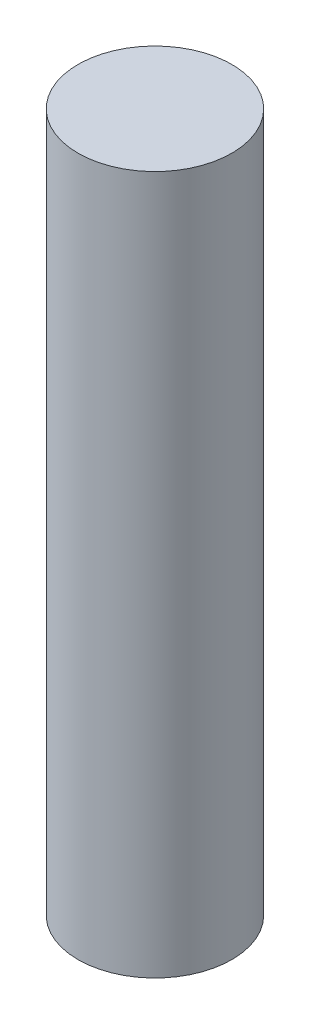
ISO-10303-21;
HEADER;
FILE_DESCRIPTION(('STEP AP214'),'2;1');
FILE_NAME('part.step','',(''),(''),'','','');
FILE_SCHEMA(('AUTOMOTIVE_DESIGN { 1 0 10303 214 1 1 1 1 }'));
ENDSEC;
DATA;
#1=APPLICATION_CONTEXT('core data for automotive mechanical design processes');
#2=APPLICATION_PROTOCOL_DEFINITION('international standard','automotive_design',2000,#1);
#3=PRODUCT_CONTEXT('',#1,'mechanical');
#4=PRODUCT('Part','Part','',(#3));
#5=PRODUCT_RELATED_PRODUCT_CATEGORY('part','',(#4));
#6=PRODUCT_DEFINITION_FORMATION('','',#4);
#7=PRODUCT_DEFINITION_CONTEXT('part definition',#1,'design');
#8=PRODUCT_DEFINITION('design','',#6,#7);
#9=PRODUCT_DEFINITION_SHAPE('','',#8);
#10=(LENGTH_UNIT() NAMED_UNIT(*) SI_UNIT(.MILLI.,.METRE.));
#11=(NAMED_UNIT(*) PLANE_ANGLE_UNIT() SI_UNIT($,.RADIAN.));
#12=(NAMED_UNIT(*) SI_UNIT($,.STERADIAN.) SOLID_ANGLE_UNIT());
#13=UNCERTAINTY_MEASURE_WITH_UNIT(LENGTH_MEASURE(1.E-05),#10,'distance_accuracy_value','');
#14=(GEOMETRIC_REPRESENTATION_CONTEXT(3) GLOBAL_UNCERTAINTY_ASSIGNED_CONTEXT((#13)) GLOBAL_UNIT_ASSIGNED_CONTEXT((#10,
#11,#12)) REPRESENTATION_CONTEXT('',''));
#15=CARTESIAN_POINT('',(0.,0.,0.));
#16=DIRECTION('',(0.,0.,1.));
#17=DIRECTION('',(1.,0.,0.));
#18=AXIS2_PLACEMENT_3D('',#15,#16,#17);
#19=CARTESIAN_POINT('',(0.,57.658,0.));
#20=DIRECTION('',(0.,-1.,0.));
#21=DIRECTION('',(0.,0.,-1.));
#22=AXIS2_PLACEMENT_3D('',#19,#20,#21);
#23=CYLINDRICAL_SURFACE('',#22,6.35);
#24=CARTESIAN_POINT('',(0.,57.658,0.));
#25=DIRECTION('',(0.,1.,0.));
#26=DIRECTION('',(0.,0.,1.));
#27=AXIS2_PLACEMENT_3D('',#24,#25,#26);
#28=CIRCLE('',#27,6.35);
#29=CARTESIAN_POINT('',(0.,57.658,6.35));
#30=VERTEX_POINT('',#29);
#31=EDGE_CURVE('E10',#30,#30,#28,.T.);
#32=ORIENTED_EDGE('',*,*,#31,.F.);
#33=EDGE_LOOP('',(#32));
#34=FACE_BOUND('',#33,.T.);
#35=CARTESIAN_POINT('',(0.,0.,0.));
#36=DIRECTION('',(0.,1.,0.));
#37=DIRECTION('',(0.,0.,1.));
#38=AXIS2_PLACEMENT_3D('',#35,#36,#37);
#39=CIRCLE('',#38,6.35);
#40=CARTESIAN_POINT('',(0.,0.,6.35));
#41=VERTEX_POINT('',#40);
#42=EDGE_CURVE('E34',#41,#41,#39,.T.);
#43=ORIENTED_EDGE('',*,*,#42,.T.);
#44=EDGE_LOOP('',(#43));
#45=FACE_BOUND('',#44,.T.);
#46=ADVANCED_FACE('F31',(#34,#45),#23,.T.);
#47=CARTESIAN_POINT('',(0.,57.658,0.));
#48=DIRECTION('',(0.,1.,0.));
#49=DIRECTION('',(0.,0.,1.));
#50=AXIS2_PLACEMENT_3D('',#47,#48,#49);
#51=PLANE('',#50);
#52=ORIENTED_EDGE('',*,*,#31,.T.);
#53=EDGE_LOOP('',(#52));
#54=FACE_BOUND('',#53,.T.);
#55=ADVANCED_FACE('F46',(#54),#51,.T.);
#56=CARTESIAN_POINT('',(0.,0.,0.));
#57=DIRECTION('',(0.,1.,0.));
#58=DIRECTION('',(0.,0.,1.));
#59=AXIS2_PLACEMENT_3D('',#56,#57,#58);
#60=PLANE('',#59);
#61=ORIENTED_EDGE('',*,*,#42,.F.);
#62=EDGE_LOOP('',(#61));
#63=FACE_BOUND('',#62,.T.);
#64=ADVANCED_FACE('F44',(#63),#60,.F.);
#65=CLOSED_SHELL('',(#46,#55,#64));
#66=MANIFOLD_SOLID_BREP('B2',#65);
#67=ADVANCED_BREP_SHAPE_REPRESENTATION('',(#18,#66),#14);
#68=SHAPE_DEFINITION_REPRESENTATION(#9,#67);
ENDSEC;
END-ISO-10303-21;
